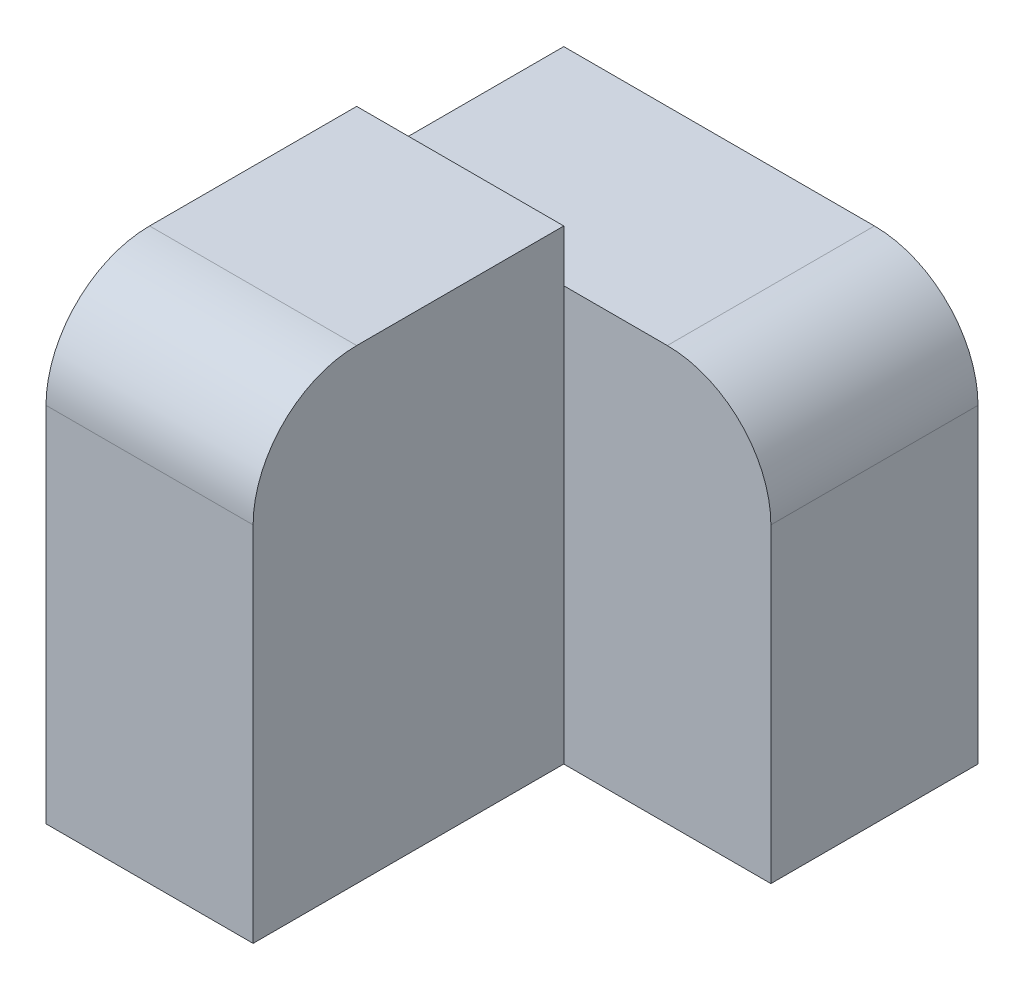
ISO-10303-21;
HEADER;
FILE_DESCRIPTION(('STEP AP214'),'2;1');
FILE_NAME('part.step','',(''),(''),'','','');
FILE_SCHEMA(('AUTOMOTIVE_DESIGN { 1 0 10303 214 1 1 1 1 }'));
ENDSEC;
DATA;
#1=APPLICATION_CONTEXT('core data for automotive mechanical design processes');
#2=APPLICATION_PROTOCOL_DEFINITION('international standard','automotive_design',2000,#1);
#3=PRODUCT_CONTEXT('',#1,'mechanical');
#4=PRODUCT('Part','Part','',(#3));
#5=PRODUCT_RELATED_PRODUCT_CATEGORY('part','',(#4));
#6=PRODUCT_DEFINITION_FORMATION('','',#4);
#7=PRODUCT_DEFINITION_CONTEXT('part definition',#1,'design');
#8=PRODUCT_DEFINITION('design','',#6,#7);
#9=PRODUCT_DEFINITION_SHAPE('','',#8);
#10=(LENGTH_UNIT() NAMED_UNIT(*) SI_UNIT(.MILLI.,.METRE.));
#11=(NAMED_UNIT(*) PLANE_ANGLE_UNIT() SI_UNIT($,.RADIAN.));
#12=(NAMED_UNIT(*) SI_UNIT($,.STERADIAN.) SOLID_ANGLE_UNIT());
#13=UNCERTAINTY_MEASURE_WITH_UNIT(LENGTH_MEASURE(1.E-05),#10,'distance_accuracy_value','');
#14=(GEOMETRIC_REPRESENTATION_CONTEXT(3) GLOBAL_UNCERTAINTY_ASSIGNED_CONTEXT((#13)) GLOBAL_UNIT_ASSIGNED_CONTEXT((#10,
#11,#12)) REPRESENTATION_CONTEXT('',''));
#15=CARTESIAN_POINT('',(0.,0.,0.));
#16=DIRECTION('',(0.,0.,1.));
#17=DIRECTION('',(1.,0.,0.));
#18=AXIS2_PLACEMENT_3D('',#15,#16,#17);
#19=CARTESIAN_POINT('',(-10.,0.,30.));
#20=DIRECTION('',(0.,-1.,0.));
#21=DIRECTION('',(1.,0.,0.));
#22=AXIS2_PLACEMENT_3D('',#19,#20,#21);
#23=PLANE('',#22);
#24=DIRECTION('',(0.,0.,-1.));
#25=VECTOR('',#24,1.);
#26=CARTESIAN_POINT('',(-30.,0.,30.));
#27=LINE('',#26,#25);
#28=CARTESIAN_POINT('',(-30.,0.,20.));
#29=VERTEX_POINT('',#28);
#30=CARTESIAN_POINT('',(-30.,0.,0.));
#31=VERTEX_POINT('',#30);
#32=EDGE_CURVE('E171',#29,#31,#27,.T.);
#33=ORIENTED_EDGE('',*,*,#32,.F.);
#34=DIRECTION('',(-1.,0.,0.));
#35=VECTOR('',#34,1.);
#36=CARTESIAN_POINT('',(-10.,0.,20.));
#37=LINE('',#36,#35);
#38=CARTESIAN_POINT('',(-10.,0.,20.));
#39=VERTEX_POINT('',#38);
#40=EDGE_CURVE('E43',#29,#39,#37,.F.);
#41=ORIENTED_EDGE('',*,*,#40,.T.);
#42=DIRECTION('',(0.,0.,-1.));
#43=VECTOR('',#42,1.);
#44=CARTESIAN_POINT('',(-10.,0.,30.));
#45=LINE('',#44,#43);
#46=CARTESIAN_POINT('',(-10.,0.,0.));
#47=VERTEX_POINT('',#46);
#48=EDGE_CURVE('E158',#39,#47,#45,.T.);
#49=ORIENTED_EDGE('',*,*,#48,.T.);
#50=DIRECTION('',(-1.,0.,0.));
#51=VECTOR('',#50,1.);
#52=CARTESIAN_POINT('',(-10.,0.,0.));
#53=LINE('',#52,#51);
#54=EDGE_CURVE('E148',#47,#31,#53,.T.);
#55=ORIENTED_EDGE('',*,*,#54,.T.);
#56=EDGE_LOOP('',(#33,#41,#49,#55));
#57=FACE_BOUND('',#56,.T.);
#58=ADVANCED_FACE('F35',(#57),#23,.F.);
#59=CARTESIAN_POINT('',(-30.,0.,30.));
#60=DIRECTION('',(1.,0.,0.));
#61=DIRECTION('',(0.,0.,-1.));
#62=AXIS2_PLACEMENT_3D('',#59,#60,#61);
#63=PLANE('',#62);
#64=DIRECTION('',(0.,-1.,0.));
#65=VECTOR('',#64,1.);
#66=CARTESIAN_POINT('',(-30.,0.,30.));
#67=LINE('',#66,#65);
#68=CARTESIAN_POINT('',(-30.,-10.,30.));
#69=VERTEX_POINT('',#68);
#70=CARTESIAN_POINT('',(-30.,-45.,30.));
#71=VERTEX_POINT('',#70);
#72=EDGE_CURVE('E150',#69,#71,#67,.T.);
#73=ORIENTED_EDGE('',*,*,#72,.F.);
#74=CARTESIAN_POINT('',(-30.,-10.,20.));
#75=DIRECTION('',(1.,0.,0.));
#76=DIRECTION('',(0.,0.,-1.));
#77=AXIS2_PLACEMENT_3D('',#74,#75,#76);
#78=CIRCLE('',#77,10.);
#79=EDGE_CURVE('E57',#69,#29,#78,.F.);
#80=ORIENTED_EDGE('',*,*,#79,.T.);
#81=ORIENTED_EDGE('',*,*,#32,.T.);
#82=DIRECTION('',(0.,-1.,0.));
#83=VECTOR('',#82,1.);
#84=CARTESIAN_POINT('',(-30.,0.,0.));
#85=LINE('',#84,#83);
#86=CARTESIAN_POINT('',(-30.,-5.,0.));
#87=VERTEX_POINT('',#86);
#88=EDGE_CURVE('E126',#31,#87,#85,.T.);
#89=ORIENTED_EDGE('',*,*,#88,.T.);
#90=DIRECTION('',(0.,0.,1.));
#91=VECTOR('',#90,1.);
#92=CARTESIAN_POINT('',(-30.,-5.,-20.));
#93=LINE('',#92,#91);
#94=CARTESIAN_POINT('',(-30.,-5.,-20.));
#95=VERTEX_POINT('',#94);
#96=EDGE_CURVE('E111',#95,#87,#93,.T.);
#97=ORIENTED_EDGE('',*,*,#96,.F.);
#98=DIRECTION('',(0.,-1.,0.));
#99=VECTOR('',#98,1.);
#100=CARTESIAN_POINT('',(-30.,-5.,-20.));
#101=LINE('',#100,#99);
#102=CARTESIAN_POINT('',(-30.,-45.,-20.));
#103=VERTEX_POINT('',#102);
#104=EDGE_CURVE('E118',#95,#103,#101,.T.);
#105=ORIENTED_EDGE('',*,*,#104,.T.);
#106=DIRECTION('',(0.,0.,-1.));
#107=VECTOR('',#106,1.);
#108=CARTESIAN_POINT('',(-30.,-45.,30.));
#109=LINE('',#108,#107);
#110=EDGE_CURVE('E169',#71,#103,#109,.T.);
#111=ORIENTED_EDGE('',*,*,#110,.F.);
#112=EDGE_LOOP('',(#73,#80,#81,#89,#97,#105,#111));
#113=FACE_BOUND('',#112,.T.);
#114=ADVANCED_FACE('F123',(#113),#63,.F.);
#115=CARTESIAN_POINT('',(-30.,-45.,30.));
#116=DIRECTION('',(0.,1.,0.));
#117=DIRECTION('',(0.,0.,1.));
#118=AXIS2_PLACEMENT_3D('',#115,#116,#117);
#119=PLANE('',#118);
#120=ORIENTED_EDGE('',*,*,#110,.T.);
#121=DIRECTION('',(1.,0.,0.));
#122=VECTOR('',#121,1.);
#123=CARTESIAN_POINT('',(-30.,-45.,-20.));
#124=LINE('',#123,#122);
#125=CARTESIAN_POINT('',(10.,-45.,-20.));
#126=VERTEX_POINT('',#125);
#127=EDGE_CURVE('E134',#103,#126,#124,.T.);
#128=ORIENTED_EDGE('',*,*,#127,.T.);
#129=DIRECTION('',(0.,0.,1.));
#130=VECTOR('',#129,1.);
#131=CARTESIAN_POINT('',(10.,-45.,-20.));
#132=LINE('',#131,#130);
#133=CARTESIAN_POINT('',(10.,-45.,0.));
#134=VERTEX_POINT('',#133);
#135=EDGE_CURVE('E127',#126,#134,#132,.T.);
#136=ORIENTED_EDGE('',*,*,#135,.T.);
#137=DIRECTION('',(1.,0.,0.));
#138=VECTOR('',#137,1.);
#139=CARTESIAN_POINT('',(-30.,-45.,0.));
#140=LINE('',#139,#138);
#141=CARTESIAN_POINT('',(-10.,-45.,0.));
#142=VERTEX_POINT('',#141);
#143=EDGE_CURVE('E142',#142,#134,#140,.T.);
#144=ORIENTED_EDGE('',*,*,#143,.F.);
#145=DIRECTION('',(0.,0.,-1.));
#146=VECTOR('',#145,1.);
#147=CARTESIAN_POINT('',(-10.,-45.,30.));
#148=LINE('',#147,#146);
#149=CARTESIAN_POINT('',(-10.,-45.,30.));
#150=VERTEX_POINT('',#149);
#151=EDGE_CURVE('E166',#150,#142,#148,.T.);
#152=ORIENTED_EDGE('',*,*,#151,.F.);
#153=DIRECTION('',(1.,0.,0.));
#154=VECTOR('',#153,1.);
#155=CARTESIAN_POINT('',(-30.,-45.,30.));
#156=LINE('',#155,#154);
#157=EDGE_CURVE('E152',#71,#150,#156,.T.);
#158=ORIENTED_EDGE('',*,*,#157,.F.);
#159=EDGE_LOOP('',(#120,#128,#136,#144,#152,#158));
#160=FACE_BOUND('',#159,.T.);
#161=ADVANCED_FACE('F193',(#160),#119,.F.);
#162=CARTESIAN_POINT('',(-10.,-45.,30.));
#163=DIRECTION('',(-1.,0.,0.));
#164=DIRECTION('',(0.,0.,1.));
#165=AXIS2_PLACEMENT_3D('',#162,#163,#164);
#166=PLANE('',#165);
#167=ORIENTED_EDGE('',*,*,#48,.F.);
#168=CARTESIAN_POINT('',(-10.,-10.,20.));
#169=DIRECTION('',(-1.,0.,0.));
#170=DIRECTION('',(0.,0.,1.));
#171=AXIS2_PLACEMENT_3D('',#168,#169,#170);
#172=CIRCLE('',#171,10.);
#173=CARTESIAN_POINT('',(-10.,-10.,30.));
#174=VERTEX_POINT('',#173);
#175=EDGE_CURVE('E11',#39,#174,#172,.F.);
#176=ORIENTED_EDGE('',*,*,#175,.T.);
#177=DIRECTION('',(0.,1.,0.));
#178=VECTOR('',#177,1.);
#179=CARTESIAN_POINT('',(-10.,-45.,30.));
#180=LINE('',#179,#178);
#181=EDGE_CURVE('E155',#150,#174,#180,.T.);
#182=ORIENTED_EDGE('',*,*,#181,.F.);
#183=ORIENTED_EDGE('',*,*,#151,.T.);
#184=DIRECTION('',(0.,1.,0.));
#185=VECTOR('',#184,1.);
#186=CARTESIAN_POINT('',(-10.,-45.,0.));
#187=LINE('',#186,#185);
#188=CARTESIAN_POINT('',(-10.,-5.,0.));
#189=VERTEX_POINT('',#188);
#190=EDGE_CURVE('E153',#142,#189,#187,.T.);
#191=ORIENTED_EDGE('',*,*,#190,.T.);
#192=EDGE_CURVE('E162',#189,#47,#187,.T.);
#193=ORIENTED_EDGE('',*,*,#192,.T.);
#194=EDGE_LOOP('',(#167,#176,#182,#183,#191,#193));
#195=FACE_BOUND('',#194,.T.);
#196=ADVANCED_FACE('F196',(#195),#166,.F.);
#197=CARTESIAN_POINT('',(0.,0.,30.));
#198=DIRECTION('',(0.,0.,1.));
#199=DIRECTION('',(1.,0.,0.));
#200=AXIS2_PLACEMENT_3D('',#197,#198,#199);
#201=PLANE('',#200);
#202=ORIENTED_EDGE('',*,*,#181,.T.);
#203=DIRECTION('',(-1.,0.,0.));
#204=VECTOR('',#203,1.);
#205=CARTESIAN_POINT('',(-30.,-10.,30.));
#206=LINE('',#205,#204);
#207=EDGE_CURVE('E181',#174,#69,#206,.T.);
#208=ORIENTED_EDGE('',*,*,#207,.T.);
#209=ORIENTED_EDGE('',*,*,#72,.T.);
#210=ORIENTED_EDGE('',*,*,#157,.T.);
#211=EDGE_LOOP('',(#202,#208,#209,#210));
#212=FACE_BOUND('',#211,.T.);
#213=ADVANCED_FACE('F186',(#212),#201,.T.);
#214=CARTESIAN_POINT('',(0.,0.,0.));
#215=DIRECTION('',(0.,0.,1.));
#216=DIRECTION('',(1.,0.,0.));
#217=AXIS2_PLACEMENT_3D('',#214,#215,#216);
#218=PLANE('',#217);
#219=ORIENTED_EDGE('',*,*,#192,.F.);
#220=DIRECTION('',(-1.,0.,0.));
#221=VECTOR('',#220,1.);
#222=CARTESIAN_POINT('',(10.,-5.,0.));
#223=LINE('',#222,#221);
#224=EDGE_CURVE('E143',#189,#87,#223,.T.);
#225=ORIENTED_EDGE('',*,*,#224,.T.);
#226=ORIENTED_EDGE('',*,*,#88,.F.);
#227=ORIENTED_EDGE('',*,*,#54,.F.);
#228=EDGE_LOOP('',(#219,#225,#226,#227));
#229=FACE_BOUND('',#228,.T.);
#230=ADVANCED_FACE('F215',(#229),#218,.F.);
#231=CARTESIAN_POINT('',(0.,0.,0.));
#232=DIRECTION('',(0.,0.,1.));
#233=DIRECTION('',(1.,0.,0.));
#234=AXIS2_PLACEMENT_3D('',#231,#232,#233);
#235=PLANE('',#234);
#236=DIRECTION('',(0.,1.,0.));
#237=VECTOR('',#236,1.);
#238=CARTESIAN_POINT('',(10.,-45.,0.));
#239=LINE('',#238,#237);
#240=CARTESIAN_POINT('',(10.,-15.,0.));
#241=VERTEX_POINT('',#240);
#242=EDGE_CURVE('E119',#134,#241,#239,.T.);
#243=ORIENTED_EDGE('',*,*,#242,.T.);
#244=CARTESIAN_POINT('',(0.,-15.,0.));
#245=DIRECTION('',(0.,0.,1.));
#246=DIRECTION('',(1.,0.,0.));
#247=AXIS2_PLACEMENT_3D('',#244,#245,#246);
#248=CIRCLE('',#247,10.);
#249=CARTESIAN_POINT('',(0.,-5.,0.));
#250=VERTEX_POINT('',#249);
#251=EDGE_CURVE('E176',#241,#250,#248,.T.);
#252=ORIENTED_EDGE('',*,*,#251,.T.);
#253=EDGE_CURVE('E140',#250,#189,#223,.T.);
#254=ORIENTED_EDGE('',*,*,#253,.T.);
#255=ORIENTED_EDGE('',*,*,#190,.F.);
#256=ORIENTED_EDGE('',*,*,#143,.T.);
#257=EDGE_LOOP('',(#243,#252,#254,#255,#256));
#258=FACE_BOUND('',#257,.T.);
#259=ADVANCED_FACE('F218',(#258),#235,.T.);
#260=CARTESIAN_POINT('',(10.,-5.,-20.));
#261=DIRECTION('',(0.,1.,0.));
#262=DIRECTION('',(-1.,0.,0.));
#263=AXIS2_PLACEMENT_3D('',#260,#261,#262);
#264=PLANE('',#263);
#265=ORIENTED_EDGE('',*,*,#253,.F.);
#266=DIRECTION('',(0.,0.,1.));
#267=VECTOR('',#266,1.);
#268=CARTESIAN_POINT('',(0.,-5.,-20.));
#269=LINE('',#268,#267);
#270=CARTESIAN_POINT('',(0.,-5.,-20.));
#271=VERTEX_POINT('',#270);
#272=EDGE_CURVE('E114',#250,#271,#269,.F.);
#273=ORIENTED_EDGE('',*,*,#272,.T.);
#274=DIRECTION('',(-1.,0.,0.));
#275=VECTOR('',#274,1.);
#276=CARTESIAN_POINT('',(10.,-5.,-20.));
#277=LINE('',#276,#275);
#278=EDGE_CURVE('E106',#271,#95,#277,.T.);
#279=ORIENTED_EDGE('',*,*,#278,.T.);
#280=ORIENTED_EDGE('',*,*,#96,.T.);
#281=ORIENTED_EDGE('',*,*,#224,.F.);
#282=EDGE_LOOP('',(#265,#273,#279,#280,#281));
#283=FACE_BOUND('',#282,.T.);
#284=ADVANCED_FACE('F109',(#283),#264,.T.);
#285=CARTESIAN_POINT('',(10.,-45.,-20.));
#286=DIRECTION('',(1.,0.,0.));
#287=DIRECTION('',(0.,0.,-1.));
#288=AXIS2_PLACEMENT_3D('',#285,#286,#287);
#289=PLANE('',#288);
#290=DIRECTION('',(0.,1.,0.));
#291=VECTOR('',#290,1.);
#292=CARTESIAN_POINT('',(10.,-45.,-20.));
#293=LINE('',#292,#291);
#294=CARTESIAN_POINT('',(10.,-15.,-20.));
#295=VERTEX_POINT('',#294);
#296=EDGE_CURVE('E128',#126,#295,#293,.T.);
#297=ORIENTED_EDGE('',*,*,#296,.T.);
#298=DIRECTION('',(0.,0.,1.));
#299=VECTOR('',#298,1.);
#300=CARTESIAN_POINT('',(10.,-15.,-20.));
#301=LINE('',#300,#299);
#302=EDGE_CURVE('E173',#295,#241,#301,.T.);
#303=ORIENTED_EDGE('',*,*,#302,.T.);
#304=ORIENTED_EDGE('',*,*,#242,.F.);
#305=ORIENTED_EDGE('',*,*,#135,.F.);
#306=EDGE_LOOP('',(#297,#303,#304,#305));
#307=FACE_BOUND('',#306,.T.);
#308=ADVANCED_FACE('F224',(#307),#289,.T.);
#309=CARTESIAN_POINT('',(0.,0.,-20.));
#310=DIRECTION('',(0.,0.,1.));
#311=DIRECTION('',(1.,0.,0.));
#312=AXIS2_PLACEMENT_3D('',#309,#310,#311);
#313=PLANE('',#312);
#314=ORIENTED_EDGE('',*,*,#278,.F.);
#315=CARTESIAN_POINT('',(0.,-15.,-20.));
#316=DIRECTION('',(0.,0.,1.));
#317=DIRECTION('',(1.,0.,0.));
#318=AXIS2_PLACEMENT_3D('',#315,#316,#317);
#319=CIRCLE('',#318,10.);
#320=EDGE_CURVE('E179',#271,#295,#319,.F.);
#321=ORIENTED_EDGE('',*,*,#320,.T.);
#322=ORIENTED_EDGE('',*,*,#296,.F.);
#323=ORIENTED_EDGE('',*,*,#127,.F.);
#324=ORIENTED_EDGE('',*,*,#104,.F.);
#325=EDGE_LOOP('',(#314,#321,#322,#323,#324));
#326=FACE_BOUND('',#325,.T.);
#327=ADVANCED_FACE('F131',(#326),#313,.F.);
#328=CARTESIAN_POINT('',(0.,-15.,-20.));
#329=DIRECTION('',(0.,0.,1.));
#330=DIRECTION('',(1.,0.,0.));
#331=AXIS2_PLACEMENT_3D('',#328,#329,#330);
#332=CYLINDRICAL_SURFACE('',#331,10.);
#333=ORIENTED_EDGE('',*,*,#320,.F.);
#334=ORIENTED_EDGE('',*,*,#272,.F.);
#335=ORIENTED_EDGE('',*,*,#251,.F.);
#336=ORIENTED_EDGE('',*,*,#302,.F.);
#337=EDGE_LOOP('',(#333,#334,#335,#336));
#338=FACE_BOUND('',#337,.T.);
#339=ADVANCED_FACE('F199',(#338),#332,.T.);
#340=CARTESIAN_POINT('',(0.,-10.,20.));
#341=DIRECTION('',(1.,0.,0.));
#342=DIRECTION('',(0.,1.,0.));
#343=AXIS2_PLACEMENT_3D('',#340,#341,#342);
#344=CYLINDRICAL_SURFACE('',#343,10.);
#345=ORIENTED_EDGE('',*,*,#175,.F.);
#346=ORIENTED_EDGE('',*,*,#40,.F.);
#347=ORIENTED_EDGE('',*,*,#79,.F.);
#348=ORIENTED_EDGE('',*,*,#207,.F.);
#349=EDGE_LOOP('',(#345,#346,#347,#348));
#350=FACE_BOUND('',#349,.T.);
#351=ADVANCED_FACE('F37',(#350),#344,.T.);
#352=CLOSED_SHELL('',(#58,#114,#161,#196,#213,#230,#259,#284,#308,#327,#339,#351));
#353=MANIFOLD_SOLID_BREP('B2',#352);
#354=ADVANCED_BREP_SHAPE_REPRESENTATION('',(#18,#353),#14);
#355=SHAPE_DEFINITION_REPRESENTATION(#9,#354);
ENDSEC;
END-ISO-10303-21;
